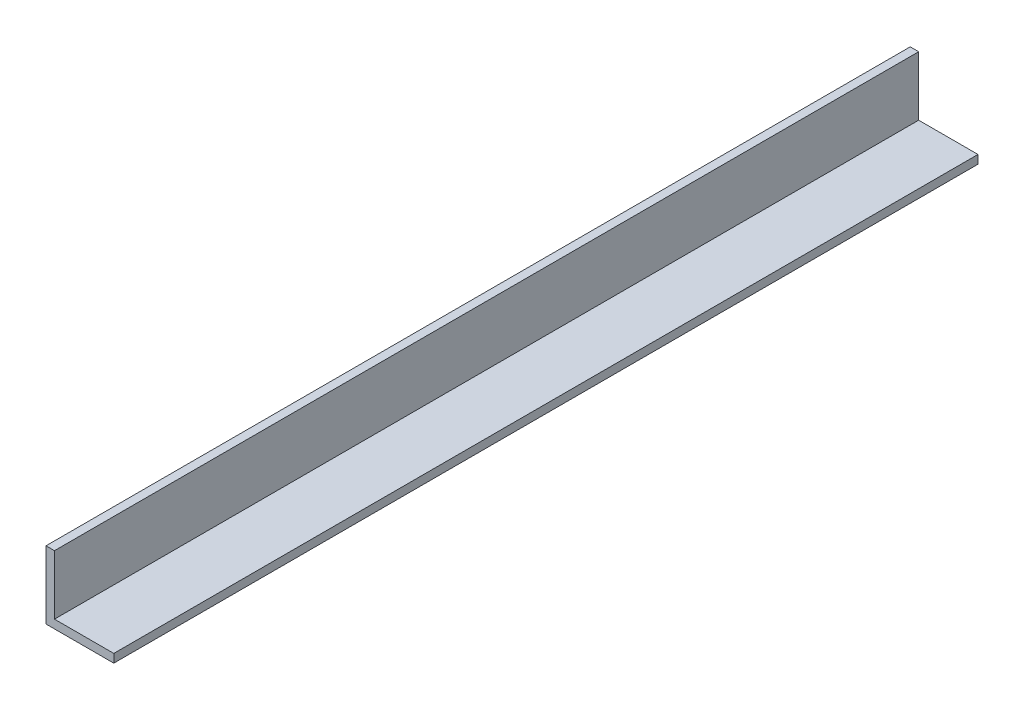
ISO-10303-21;
HEADER;
FILE_DESCRIPTION(('STEP AP214'),'2;1');
FILE_NAME('part.step','',(''),(''),'','','');
FILE_SCHEMA(('AUTOMOTIVE_DESIGN { 1 0 10303 214 1 1 1 1 }'));
ENDSEC;
DATA;
#1=APPLICATION_CONTEXT('core data for automotive mechanical design processes');
#2=APPLICATION_PROTOCOL_DEFINITION('international standard','automotive_design',2000,#1);
#3=PRODUCT_CONTEXT('',#1,'mechanical');
#4=PRODUCT('Part','Part','',(#3));
#5=PRODUCT_RELATED_PRODUCT_CATEGORY('part','',(#4));
#6=PRODUCT_DEFINITION_FORMATION('','',#4);
#7=PRODUCT_DEFINITION_CONTEXT('part definition',#1,'design');
#8=PRODUCT_DEFINITION('design','',#6,#7);
#9=PRODUCT_DEFINITION_SHAPE('','',#8);
#10=(LENGTH_UNIT() NAMED_UNIT(*) SI_UNIT(.MILLI.,.METRE.));
#11=(NAMED_UNIT(*) PLANE_ANGLE_UNIT() SI_UNIT($,.RADIAN.));
#12=(NAMED_UNIT(*) SI_UNIT($,.STERADIAN.) SOLID_ANGLE_UNIT());
#13=UNCERTAINTY_MEASURE_WITH_UNIT(LENGTH_MEASURE(1.E-05),#10,'distance_accuracy_value','');
#14=(GEOMETRIC_REPRESENTATION_CONTEXT(3) GLOBAL_UNCERTAINTY_ASSIGNED_CONTEXT((#13)) GLOBAL_UNIT_ASSIGNED_CONTEXT((#10,
#11,#12)) REPRESENTATION_CONTEXT('',''));
#15=CARTESIAN_POINT('',(0.,0.,0.));
#16=DIRECTION('',(0.,0.,1.));
#17=DIRECTION('',(1.,0.,0.));
#18=AXIS2_PLACEMENT_3D('',#15,#16,#17);
#19=CARTESIAN_POINT('',(0.,0.,323.85));
#20=DIRECTION('',(1.,0.,0.));
#21=DIRECTION('',(0.,0.,-1.));
#22=AXIS2_PLACEMENT_3D('',#19,#20,#21);
#23=PLANE('',#22);
#24=DIRECTION('',(0.,-1.,0.));
#25=VECTOR('',#24,1.);
#26=CARTESIAN_POINT('',(0.,0.,0.));
#27=LINE('',#26,#25);
#28=CARTESIAN_POINT('',(0.,25.4,0.));
#29=VERTEX_POINT('',#28);
#30=CARTESIAN_POINT('',(0.,0.,0.));
#31=VERTEX_POINT('',#30);
#32=EDGE_CURVE('E119',#29,#31,#27,.T.);
#33=ORIENTED_EDGE('',*,*,#32,.T.);
#34=DIRECTION('',(0.,0.,-1.));
#35=VECTOR('',#34,1.);
#36=CARTESIAN_POINT('',(0.,0.,323.85));
#37=LINE('',#36,#35);
#38=CARTESIAN_POINT('',(0.,0.,323.85));
#39=VERTEX_POINT('',#38);
#40=EDGE_CURVE('E11',#39,#31,#37,.T.);
#41=ORIENTED_EDGE('',*,*,#40,.F.);
#42=DIRECTION('',(0.,-1.,0.));
#43=VECTOR('',#42,1.);
#44=CARTESIAN_POINT('',(0.,0.,323.85));
#45=LINE('',#44,#43);
#46=CARTESIAN_POINT('',(0.,25.4,323.85));
#47=VERTEX_POINT('',#46);
#48=EDGE_CURVE('E129',#47,#39,#45,.T.);
#49=ORIENTED_EDGE('',*,*,#48,.F.);
#50=DIRECTION('',(0.,0.,-1.));
#51=VECTOR('',#50,1.);
#52=CARTESIAN_POINT('',(0.,25.4,323.85));
#53=LINE('',#52,#51);
#54=EDGE_CURVE('E115',#47,#29,#53,.T.);
#55=ORIENTED_EDGE('',*,*,#54,.T.);
#56=EDGE_LOOP('',(#33,#41,#49,#55));
#57=FACE_BOUND('',#56,.T.);
#58=ADVANCED_FACE('F35',(#57),#23,.F.);
#59=CARTESIAN_POINT('',(0.,0.,323.85));
#60=DIRECTION('',(0.,1.,0.));
#61=DIRECTION('',(0.,0.,1.));
#62=AXIS2_PLACEMENT_3D('',#59,#60,#61);
#63=PLANE('',#62);
#64=DIRECTION('',(1.,0.,0.));
#65=VECTOR('',#64,1.);
#66=CARTESIAN_POINT('',(0.,0.,0.));
#67=LINE('',#66,#65);
#68=CARTESIAN_POINT('',(25.4,0.,0.));
#69=VERTEX_POINT('',#68);
#70=EDGE_CURVE('E122',#31,#69,#67,.T.);
#71=ORIENTED_EDGE('',*,*,#70,.T.);
#72=DIRECTION('',(0.,0.,-1.));
#73=VECTOR('',#72,1.);
#74=CARTESIAN_POINT('',(25.4,0.,323.85));
#75=LINE('',#74,#73);
#76=CARTESIAN_POINT('',(25.4,0.,323.85));
#77=VERTEX_POINT('',#76);
#78=EDGE_CURVE('E43',#77,#69,#75,.T.);
#79=ORIENTED_EDGE('',*,*,#78,.F.);
#80=DIRECTION('',(1.,0.,0.));
#81=VECTOR('',#80,1.);
#82=CARTESIAN_POINT('',(0.,0.,323.85));
#83=LINE('',#82,#81);
#84=EDGE_CURVE('E88',#39,#77,#83,.T.);
#85=ORIENTED_EDGE('',*,*,#84,.F.);
#86=ORIENTED_EDGE('',*,*,#40,.T.);
#87=EDGE_LOOP('',(#71,#79,#85,#86));
#88=FACE_BOUND('',#87,.T.);
#89=ADVANCED_FACE('F153',(#88),#63,.F.);
#90=CARTESIAN_POINT('',(25.4,0.,323.85));
#91=DIRECTION('',(-1.,0.,0.));
#92=DIRECTION('',(0.,0.,1.));
#93=AXIS2_PLACEMENT_3D('',#90,#91,#92);
#94=PLANE('',#93);
#95=DIRECTION('',(0.,1.,0.));
#96=VECTOR('',#95,1.);
#97=CARTESIAN_POINT('',(25.4,0.,0.));
#98=LINE('',#97,#96);
#99=CARTESIAN_POINT('',(25.4,3.175,0.));
#100=VERTEX_POINT('',#99);
#101=EDGE_CURVE('E124',#69,#100,#98,.T.);
#102=ORIENTED_EDGE('',*,*,#101,.T.);
#103=DIRECTION('',(0.,0.,-1.));
#104=VECTOR('',#103,1.);
#105=CARTESIAN_POINT('',(25.4,3.175,323.85));
#106=LINE('',#105,#104);
#107=CARTESIAN_POINT('',(25.4,3.175,323.85));
#108=VERTEX_POINT('',#107);
#109=EDGE_CURVE('E110',#108,#100,#106,.T.);
#110=ORIENTED_EDGE('',*,*,#109,.F.);
#111=DIRECTION('',(0.,1.,0.));
#112=VECTOR('',#111,1.);
#113=CARTESIAN_POINT('',(25.4,0.,323.85));
#114=LINE('',#113,#112);
#115=EDGE_CURVE('E101',#77,#108,#114,.T.);
#116=ORIENTED_EDGE('',*,*,#115,.F.);
#117=ORIENTED_EDGE('',*,*,#78,.T.);
#118=EDGE_LOOP('',(#102,#110,#116,#117));
#119=FACE_BOUND('',#118,.T.);
#120=ADVANCED_FACE('F135',(#119),#94,.F.);
#121=CARTESIAN_POINT('',(25.4,3.175,323.85));
#122=DIRECTION('',(0.,-1.,0.));
#123=DIRECTION('',(1.,0.,0.));
#124=AXIS2_PLACEMENT_3D('',#121,#122,#123);
#125=PLANE('',#124);
#126=DIRECTION('',(-1.,0.,0.));
#127=VECTOR('',#126,1.);
#128=CARTESIAN_POINT('',(25.4,3.175,0.));
#129=LINE('',#128,#127);
#130=CARTESIAN_POINT('',(3.175,3.175,0.));
#131=VERTEX_POINT('',#130);
#132=EDGE_CURVE('E109',#100,#131,#129,.T.);
#133=ORIENTED_EDGE('',*,*,#132,.T.);
#134=DIRECTION('',(0.,0.,-1.));
#135=VECTOR('',#134,1.);
#136=CARTESIAN_POINT('',(3.175,3.175,323.85));
#137=LINE('',#136,#135);
#138=CARTESIAN_POINT('',(3.175,3.175,323.85));
#139=VERTEX_POINT('',#138);
#140=EDGE_CURVE('E106',#139,#131,#137,.T.);
#141=ORIENTED_EDGE('',*,*,#140,.F.);
#142=DIRECTION('',(-1.,0.,0.));
#143=VECTOR('',#142,1.);
#144=CARTESIAN_POINT('',(25.4,3.175,323.85));
#145=LINE('',#144,#143);
#146=EDGE_CURVE('E95',#108,#139,#145,.T.);
#147=ORIENTED_EDGE('',*,*,#146,.F.);
#148=ORIENTED_EDGE('',*,*,#109,.T.);
#149=EDGE_LOOP('',(#133,#141,#147,#148));
#150=FACE_BOUND('',#149,.T.);
#151=ADVANCED_FACE('F107',(#150),#125,.F.);
#152=CARTESIAN_POINT('',(3.175,25.4,323.85));
#153=DIRECTION('',(-1.,0.,0.));
#154=DIRECTION('',(0.,-1.,0.));
#155=AXIS2_PLACEMENT_3D('',#152,#153,#154);
#156=PLANE('',#155);
#157=DIRECTION('',(0.,1.,0.));
#158=VECTOR('',#157,1.);
#159=CARTESIAN_POINT('',(3.175,25.4,0.));
#160=LINE('',#159,#158);
#161=CARTESIAN_POINT('',(3.175,25.4,0.));
#162=VERTEX_POINT('',#161);
#163=EDGE_CURVE('E74',#131,#162,#160,.T.);
#164=ORIENTED_EDGE('',*,*,#163,.T.);
#165=DIRECTION('',(0.,0.,-1.));
#166=VECTOR('',#165,1.);
#167=CARTESIAN_POINT('',(3.175,25.4,323.85));
#168=LINE('',#167,#166);
#169=CARTESIAN_POINT('',(3.175,25.4,323.85));
#170=VERTEX_POINT('',#169);
#171=EDGE_CURVE('E111',#170,#162,#168,.T.);
#172=ORIENTED_EDGE('',*,*,#171,.F.);
#173=DIRECTION('',(0.,1.,0.));
#174=VECTOR('',#173,1.);
#175=CARTESIAN_POINT('',(3.175,25.4,323.85));
#176=LINE('',#175,#174);
#177=EDGE_CURVE('E99',#139,#170,#176,.T.);
#178=ORIENTED_EDGE('',*,*,#177,.F.);
#179=ORIENTED_EDGE('',*,*,#140,.T.);
#180=EDGE_LOOP('',(#164,#172,#178,#179));
#181=FACE_BOUND('',#180,.T.);
#182=ADVANCED_FACE('F113',(#181),#156,.F.);
#183=CARTESIAN_POINT('',(0.,25.4,323.85));
#184=DIRECTION('',(0.,-1.,0.));
#185=DIRECTION('',(0.,0.,-1.));
#186=AXIS2_PLACEMENT_3D('',#183,#184,#185);
#187=PLANE('',#186);
#188=DIRECTION('',(-1.,0.,0.));
#189=VECTOR('',#188,1.);
#190=CARTESIAN_POINT('',(0.,25.4,0.));
#191=LINE('',#190,#189);
#192=EDGE_CURVE('E80',#162,#29,#191,.T.);
#193=ORIENTED_EDGE('',*,*,#192,.T.);
#194=ORIENTED_EDGE('',*,*,#54,.F.);
#195=DIRECTION('',(-1.,0.,0.));
#196=VECTOR('',#195,1.);
#197=CARTESIAN_POINT('',(0.,25.4,323.85));
#198=LINE('',#197,#196);
#199=EDGE_CURVE('E51',#170,#47,#198,.T.);
#200=ORIENTED_EDGE('',*,*,#199,.F.);
#201=ORIENTED_EDGE('',*,*,#171,.T.);
#202=EDGE_LOOP('',(#193,#194,#200,#201));
#203=FACE_BOUND('',#202,.T.);
#204=ADVANCED_FACE('F142',(#203),#187,.F.);
#205=CARTESIAN_POINT('',(0.,0.,323.85));
#206=DIRECTION('',(0.,0.,-1.));
#207=DIRECTION('',(-1.,0.,0.));
#208=AXIS2_PLACEMENT_3D('',#205,#206,#207);
#209=PLANE('',#208);
#210=ORIENTED_EDGE('',*,*,#48,.T.);
#211=ORIENTED_EDGE('',*,*,#84,.T.);
#212=ORIENTED_EDGE('',*,*,#115,.T.);
#213=ORIENTED_EDGE('',*,*,#146,.T.);
#214=ORIENTED_EDGE('',*,*,#177,.T.);
#215=ORIENTED_EDGE('',*,*,#199,.T.);
#216=EDGE_LOOP('',(#210,#211,#212,#213,#214,#215));
#217=FACE_BOUND('',#216,.T.);
#218=ADVANCED_FACE('F97',(#217),#209,.F.);
#219=CARTESIAN_POINT('',(0.,0.,0.));
#220=DIRECTION('',(0.,0.,-1.));
#221=DIRECTION('',(-1.,0.,0.));
#222=AXIS2_PLACEMENT_3D('',#219,#220,#221);
#223=PLANE('',#222);
#224=ORIENTED_EDGE('',*,*,#32,.F.);
#225=ORIENTED_EDGE('',*,*,#192,.F.);
#226=ORIENTED_EDGE('',*,*,#163,.F.);
#227=ORIENTED_EDGE('',*,*,#132,.F.);
#228=ORIENTED_EDGE('',*,*,#101,.F.);
#229=ORIENTED_EDGE('',*,*,#70,.F.);
#230=EDGE_LOOP('',(#224,#225,#226,#227,#228,#229));
#231=FACE_BOUND('',#230,.T.);
#232=ADVANCED_FACE('F138',(#231),#223,.T.);
#233=CLOSED_SHELL('',(#58,#89,#120,#151,#182,#204,#218,#232));
#234=MANIFOLD_SOLID_BREP('B2',#233);
#235=ADVANCED_BREP_SHAPE_REPRESENTATION('',(#18,#234),#14);
#236=SHAPE_DEFINITION_REPRESENTATION(#9,#235);
ENDSEC;
END-ISO-10303-21;
